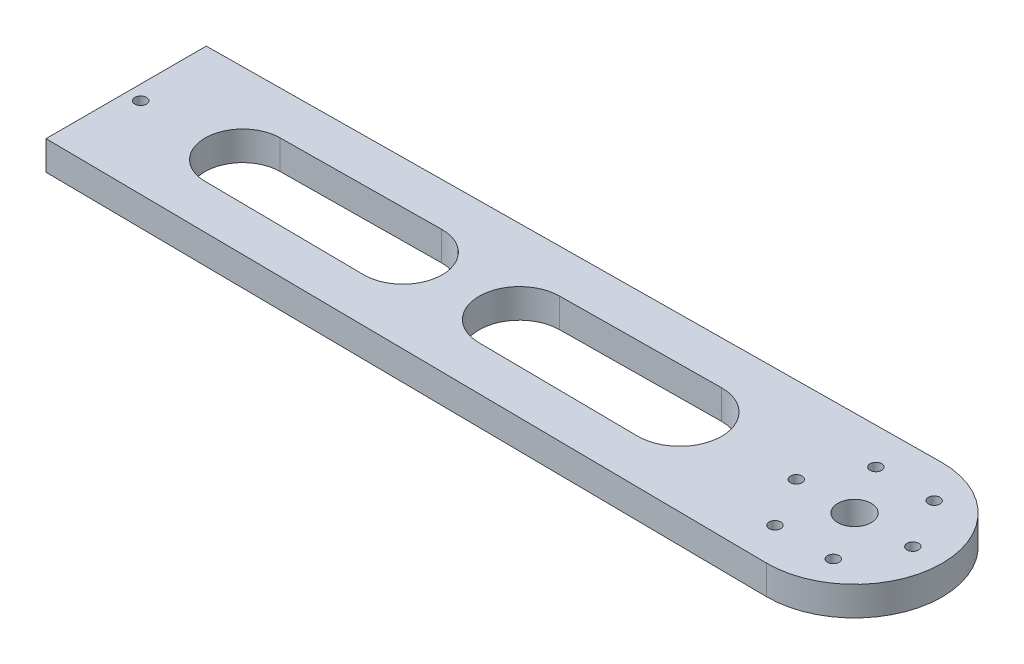
ISO-10303-21;
HEADER;
FILE_DESCRIPTION(('STEP AP214'),'2;1');
FILE_NAME('part.step','',(''),(''),'','','');
FILE_SCHEMA(('AUTOMOTIVE_DESIGN { 1 0 10303 214 1 1 1 1 }'));
ENDSEC;
DATA;
#1=APPLICATION_CONTEXT('core data for automotive mechanical design processes');
#2=APPLICATION_PROTOCOL_DEFINITION('international standard','automotive_design',2000,#1);
#3=PRODUCT_CONTEXT('',#1,'mechanical');
#4=PRODUCT('Part','Part','',(#3));
#5=PRODUCT_RELATED_PRODUCT_CATEGORY('part','',(#4));
#6=PRODUCT_DEFINITION_FORMATION('','',#4);
#7=PRODUCT_DEFINITION_CONTEXT('part definition',#1,'design');
#8=PRODUCT_DEFINITION('design','',#6,#7);
#9=PRODUCT_DEFINITION_SHAPE('','',#8);
#10=(LENGTH_UNIT() NAMED_UNIT(*) SI_UNIT(.MILLI.,.METRE.));
#11=(NAMED_UNIT(*) PLANE_ANGLE_UNIT() SI_UNIT($,.RADIAN.));
#12=(NAMED_UNIT(*) SI_UNIT($,.STERADIAN.) SOLID_ANGLE_UNIT());
#13=UNCERTAINTY_MEASURE_WITH_UNIT(LENGTH_MEASURE(1.E-05),#10,'distance_accuracy_value','');
#14=(GEOMETRIC_REPRESENTATION_CONTEXT(3) GLOBAL_UNCERTAINTY_ASSIGNED_CONTEXT((#13)) GLOBAL_UNIT_ASSIGNED_CONTEXT((#10,
#11,#12)) REPRESENTATION_CONTEXT('',''));
#15=CARTESIAN_POINT('',(0.,0.,0.));
#16=DIRECTION('',(0.,0.,1.));
#17=DIRECTION('',(1.,0.,0.));
#18=AXIS2_PLACEMENT_3D('',#15,#16,#17);
#19=CARTESIAN_POINT('',(33.6152394142152,10.,-9.95522460733301));
#20=DIRECTION('',(0.,1.,0.));
#21=DIRECTION('',(0.,0.,1.));
#22=AXIS2_PLACEMENT_3D('',#19,#20,#21);
#23=PLANE('',#22);
#24=DIRECTION('',(0.999948973181895,0.,0.0101020311063743));
#25=VECTOR('',#24,1.);
#26=CARTESIAN_POINT('',(-81.52466678409,10.,3.88233456528161));
#27=LINE('',#26,#25);
#28=CARTESIAN_POINT('',(-81.52466678409,10.,3.88233456528161));
#29=VERTEX_POINT('',#28);
#30=CARTESIAN_POINT('',(-26.5302262167507,10.,4.43791846424908));
#31=VERTEX_POINT('',#30);
#32=EDGE_CURVE('E130',#29,#31,#27,.T.);
#33=ORIENTED_EDGE('',*,*,#32,.F.);
#34=CARTESIAN_POINT('',(-81.3847600499998,10.,-9.96632553302472));
#35=DIRECTION('',(0.,1.,0.));
#36=DIRECTION('',(0.,0.,1.));
#37=AXIS2_PLACEMENT_3D('',#34,#35,#36);
#38=CIRCLE('',#37,13.8493667874263);
#39=CARTESIAN_POINT('',(-81.5219931650311,10.,-23.8150123835822));
#40=VERTEX_POINT('',#39);
#41=EDGE_CURVE('E122',#40,#29,#38,.T.);
#42=ORIENTED_EDGE('',*,*,#41,.F.);
#43=DIRECTION('',(-0.999950904840691,0.,0.00990898119298126));
#44=VECTOR('',#43,1.);
#45=CARTESIAN_POINT('',(-81.5219931650311,10.,-23.8150123835822));
#46=LINE('',#45,#44);
#47=CARTESIAN_POINT('',(-26.5274463617761,10.,-24.3599790687984));
#48=VERTEX_POINT('',#47);
#49=EDGE_CURVE('E145',#48,#40,#46,.T.);
#50=ORIENTED_EDGE('',*,*,#49,.F.);
#51=CARTESIAN_POINT('',(-26.3847603062448,10.,-9.96101639465042));
#52=DIRECTION('',(0.,1.,0.));
#53=DIRECTION('',(0.,0.,1.));
#54=AXIS2_PLACEMENT_3D('',#51,#52,#53);
#55=CIRCLE('',#54,14.3996696282224);
#56=EDGE_CURVE('E143',#31,#48,#55,.T.);
#57=ORIENTED_EDGE('',*,*,#56,.F.);
#58=EDGE_LOOP('',(#33,#42,#50,#57));
#59=FACE_BOUND('',#58,.T.);
#60=CARTESIAN_POINT('',(23.6152394142153,10.,-27.2757326830219));
#61=DIRECTION('',(0.,1.,0.));
#62=DIRECTION('',(0.,0.,1.));
#63=AXIS2_PLACEMENT_3D('',#60,#61,#62);
#64=CIRCLE('',#63,2.);
#65=CARTESIAN_POINT('',(23.6152394142153,10.,-25.2757326830219));
#66=VERTEX_POINT('',#65);
#67=EDGE_CURVE('E161',#66,#66,#64,.T.);
#68=ORIENTED_EDGE('',*,*,#67,.F.);
#69=EDGE_LOOP('',(#68));
#70=FACE_BOUND('',#69,.T.);
#71=CARTESIAN_POINT('',(23.6152394142151,10.,7.36528346835572));
#72=DIRECTION('',(0.,1.,0.));
#73=DIRECTION('',(0.,0.,1.));
#74=AXIS2_PLACEMENT_3D('',#71,#72,#73);
#75=CIRCLE('',#74,2.);
#76=CARTESIAN_POINT('',(23.6152394142151,10.,9.36528346835572));
#77=VERTEX_POINT('',#76);
#78=EDGE_CURVE('E173',#77,#77,#75,.T.);
#79=ORIENTED_EDGE('',*,*,#78,.F.);
#80=EDGE_LOOP('',(#79));
#81=FACE_BOUND('',#80,.T.);
#82=CARTESIAN_POINT('',(-211.384759397752,10.,-9.97935692636639));
#83=DIRECTION('',(0.,1.,0.));
#84=DIRECTION('',(0.,0.,1.));
#85=AXIS2_PLACEMENT_3D('',#82,#83,#84);
#86=CIRCLE('',#85,2.);
#87=CARTESIAN_POINT('',(-211.384759397752,10.,-7.9793569263664));
#88=VERTEX_POINT('',#87);
#89=EDGE_CURVE('E185',#88,#88,#86,.T.);
#90=ORIENTED_EDGE('',*,*,#89,.F.);
#91=EDGE_LOOP('',(#90));
#92=FACE_BOUND('',#91,.T.);
#93=CARTESIAN_POINT('',(33.6152394142152,10.,-9.95522460733301));
#94=DIRECTION('',(0.,1.,0.));
#95=DIRECTION('',(0.,0.,1.));
#96=AXIS2_PLACEMENT_3D('',#93,#94,#95);
#97=CIRCLE('',#96,5.75);
#98=CARTESIAN_POINT('',(33.6152394142152,10.,-4.20522460733302));
#99=VERTEX_POINT('',#98);
#100=EDGE_CURVE('E228',#99,#99,#97,.T.);
#101=ORIENTED_EDGE('',*,*,#100,.F.);
#102=EDGE_LOOP('',(#101));
#103=FACE_BOUND('',#102,.T.);
#104=DIRECTION('',(-9.65297886194745E-05,0.,0.999999995341));
#105=VECTOR('',#104,1.);
#106=CARTESIAN_POINT('',(-216.382104851848,10.,-37.4793569263664));
#107=LINE('',#106,#105);
#108=CARTESIAN_POINT('',(-216.382104851848,10.,-37.4793569263664));
#109=VERTEX_POINT('',#108);
#110=CARTESIAN_POINT('',(-216.387413990222,10.,17.5206428173886));
#111=VERTEX_POINT('',#110);
#112=EDGE_CURVE('E234',#109,#111,#107,.T.);
#113=ORIENTED_EDGE('',*,*,#112,.T.);
#114=DIRECTION('',(0.999948973181895,0.,0.0101020311063743));
#115=VECTOR('',#114,1.);
#116=CARTESIAN_POINT('',(-216.387413990222,10.,17.5206428173886));
#117=LINE('',#116,#115);
#118=CARTESIAN_POINT('',(33.3121784810239,10.,20.0432445881238));
#119=VERTEX_POINT('',#118);
#120=EDGE_CURVE('E237',#111,#119,#117,.T.);
#121=ORIENTED_EDGE('',*,*,#120,.T.);
#122=CARTESIAN_POINT('',(33.6152394142152,10.,-9.95522460733301));
#123=DIRECTION('',(0.,1.,0.));
#124=DIRECTION('',(0.,0.,1.));
#125=AXIS2_PLACEMENT_3D('',#122,#123,#124);
#126=CIRCLE('',#125,30.);
#127=CARTESIAN_POINT('',(33.3179699784257,10.,-39.9537517525538));
#128=VERTEX_POINT('',#127);
#129=EDGE_CURVE('E240',#119,#128,#126,.T.);
#130=ORIENTED_EDGE('',*,*,#129,.T.);
#131=DIRECTION('',(-0.999950904840691,0.,0.00990898119298121));
#132=VECTOR('',#131,1.);
#133=CARTESIAN_POINT('',(-216.382104851848,10.,-37.4793569263664));
#134=LINE('',#133,#132);
#135=EDGE_CURVE('E242',#128,#109,#134,.T.);
#136=ORIENTED_EDGE('',*,*,#135,.T.);
#137=EDGE_LOOP('',(#113,#121,#130,#136));
#138=FACE_BOUND('',#137,.T.);
#139=CARTESIAN_POINT('',(53.6152394142152,10.,-9.95522460733301));
#140=DIRECTION('',(0.,1.,0.));
#141=DIRECTION('',(0.,0.,1.));
#142=AXIS2_PLACEMENT_3D('',#139,#140,#141);
#143=CIRCLE('',#142,2.);
#144=CARTESIAN_POINT('',(53.6152394142152,10.,-7.95522460733301));
#145=VERTEX_POINT('',#144);
#146=EDGE_CURVE('E222',#145,#145,#143,.T.);
#147=ORIENTED_EDGE('',*,*,#146,.F.);
#148=EDGE_LOOP('',(#147));
#149=FACE_BOUND('',#148,.T.);
#150=DIRECTION('',(-0.999950904840691,0.,0.00990898119298113));
#151=VECTOR('',#150,1.);
#152=CARTESIAN_POINT('',(-176.512574007017,10.,-22.873706290936));
#153=LINE('',#152,#151);
#154=CARTESIAN_POINT('',(-121.518027203762,10.,-23.4186729761523));
#155=VERTEX_POINT('',#154);
#156=CARTESIAN_POINT('',(-176.512574007017,10.,-22.873706290936));
#157=VERTEX_POINT('',#156);
#158=EDGE_CURVE('E193',#155,#157,#153,.T.);
#159=ORIENTED_EDGE('',*,*,#158,.F.);
#160=CARTESIAN_POINT('',(-121.38475986364,10.,-9.97018672456965));
#161=DIRECTION('',(0.,1.,0.));
#162=DIRECTION('',(0.,0.,1.));
#163=AXIS2_PLACEMENT_3D('',#160,#161,#162);
#164=CIRCLE('',#163,13.4491465395745);
#165=CARTESIAN_POINT('',(-121.520623560337,10.,3.47827354785072));
#166=VERTEX_POINT('',#165);
#167=EDGE_CURVE('E191',#166,#155,#164,.T.);
#168=ORIENTED_EDGE('',*,*,#167,.F.);
#169=DIRECTION('',(0.999948973181895,0.,0.0101020311063743));
#170=VECTOR('',#169,1.);
#171=CARTESIAN_POINT('',(-176.515064127676,10.,2.92268964888325));
#172=LINE('',#171,#170);
#173=CARTESIAN_POINT('',(-176.515064127676,10.,2.92268964888325));
#174=VERTEX_POINT('',#173);
#175=EDGE_CURVE('E199',#174,#166,#172,.T.);
#176=ORIENTED_EDGE('',*,*,#175,.F.);
#177=CARTESIAN_POINT('',(-176.384759607395,10.,-9.97549586294395));
#178=DIRECTION('',(0.,1.,0.));
#179=DIRECTION('',(0.,0.,1.));
#180=AXIS2_PLACEMENT_3D('',#177,#178,#179);
#181=CIRCLE('',#180,12.8988436987784);
#182=EDGE_CURVE('E196',#157,#174,#181,.T.);
#183=ORIENTED_EDGE('',*,*,#182,.F.);
#184=EDGE_LOOP('',(#159,#168,#176,#183));
#185=FACE_BOUND('',#184,.T.);
#186=CARTESIAN_POINT('',(43.6152394142151,10.,7.36528346835578));
#187=DIRECTION('',(0.,1.,0.));
#188=DIRECTION('',(0.,0.,1.));
#189=AXIS2_PLACEMENT_3D('',#186,#187,#188);
#190=CIRCLE('',#189,2.);
#191=CARTESIAN_POINT('',(43.6152394142151,10.,9.36528346835578));
#192=VERTEX_POINT('',#191);
#193=EDGE_CURVE('E179',#192,#192,#190,.T.);
#194=ORIENTED_EDGE('',*,*,#193,.F.);
#195=EDGE_LOOP('',(#194));
#196=FACE_BOUND('',#195,.T.);
#197=CARTESIAN_POINT('',(13.6152394142152,10.,-9.95522460733315));
#198=DIRECTION('',(0.,1.,0.));
#199=DIRECTION('',(0.,0.,1.));
#200=AXIS2_PLACEMENT_3D('',#197,#198,#199);
#201=CIRCLE('',#200,2.);
#202=CARTESIAN_POINT('',(13.6152394142152,10.,-7.95522460733315));
#203=VERTEX_POINT('',#202);
#204=EDGE_CURVE('E167',#203,#203,#201,.T.);
#205=ORIENTED_EDGE('',*,*,#204,.F.);
#206=EDGE_LOOP('',(#205));
#207=FACE_BOUND('',#206,.T.);
#208=CARTESIAN_POINT('',(43.6152394142154,10.,-27.2757326830217));
#209=DIRECTION('',(0.,1.,0.));
#210=DIRECTION('',(0.,0.,1.));
#211=AXIS2_PLACEMENT_3D('',#208,#209,#210);
#212=CIRCLE('',#211,2.);
#213=CARTESIAN_POINT('',(43.6152394142154,10.,-25.2757326830217));
#214=VERTEX_POINT('',#213);
#215=EDGE_CURVE('E151',#214,#214,#212,.T.);
#216=ORIENTED_EDGE('',*,*,#215,.F.);
#217=EDGE_LOOP('',(#216));
#218=FACE_BOUND('',#217,.T.);
#219=ADVANCED_FACE('F33',(#59,#70,#81,#92,#103,#138,#149,#185,#196,#207,#218),#23,.T.);
#220=CARTESIAN_POINT('',(33.6152394142152,0.,-9.95522460733301));
#221=DIRECTION('',(0.,1.,0.));
#222=DIRECTION('',(0.,0.,1.));
#223=AXIS2_PLACEMENT_3D('',#220,#221,#222);
#224=PLANE('',#223);
#225=CARTESIAN_POINT('',(23.6152394142153,0.,-27.2757326830219));
#226=DIRECTION('',(0.,1.,0.));
#227=DIRECTION('',(0.,0.,1.));
#228=AXIS2_PLACEMENT_3D('',#225,#226,#227);
#229=CIRCLE('',#228,2.);
#230=CARTESIAN_POINT('',(23.6152394142153,0.,-25.2757326830219));
#231=VERTEX_POINT('',#230);
#232=EDGE_CURVE('E138',#231,#231,#229,.T.);
#233=ORIENTED_EDGE('',*,*,#232,.T.);
#234=EDGE_LOOP('',(#233));
#235=FACE_BOUND('',#234,.T.);
#236=CARTESIAN_POINT('',(13.6152394142152,0.,-9.95522460733315));
#237=DIRECTION('',(0.,1.,0.));
#238=DIRECTION('',(0.,0.,1.));
#239=AXIS2_PLACEMENT_3D('',#236,#237,#238);
#240=CIRCLE('',#239,2.);
#241=CARTESIAN_POINT('',(13.6152394142152,0.,-7.95522460733315));
#242=VERTEX_POINT('',#241);
#243=EDGE_CURVE('E164',#242,#242,#240,.T.);
#244=ORIENTED_EDGE('',*,*,#243,.T.);
#245=EDGE_LOOP('',(#244));
#246=FACE_BOUND('',#245,.T.);
#247=CARTESIAN_POINT('',(23.6152394142151,0.,7.36528346835572));
#248=DIRECTION('',(0.,1.,0.));
#249=DIRECTION('',(0.,0.,1.));
#250=AXIS2_PLACEMENT_3D('',#247,#248,#249);
#251=CIRCLE('',#250,2.);
#252=CARTESIAN_POINT('',(23.6152394142151,0.,9.36528346835572));
#253=VERTEX_POINT('',#252);
#254=EDGE_CURVE('E170',#253,#253,#251,.T.);
#255=ORIENTED_EDGE('',*,*,#254,.T.);
#256=EDGE_LOOP('',(#255));
#257=FACE_BOUND('',#256,.T.);
#258=CARTESIAN_POINT('',(43.6152394142151,0.,7.36528346835578));
#259=DIRECTION('',(0.,1.,0.));
#260=DIRECTION('',(0.,0.,1.));
#261=AXIS2_PLACEMENT_3D('',#258,#259,#260);
#262=CIRCLE('',#261,2.);
#263=CARTESIAN_POINT('',(43.6152394142151,0.,9.36528346835578));
#264=VERTEX_POINT('',#263);
#265=EDGE_CURVE('E176',#264,#264,#262,.T.);
#266=ORIENTED_EDGE('',*,*,#265,.T.);
#267=EDGE_LOOP('',(#266));
#268=FACE_BOUND('',#267,.T.);
#269=CARTESIAN_POINT('',(-211.384759397752,0.,-9.97935692636639));
#270=DIRECTION('',(0.,1.,0.));
#271=DIRECTION('',(0.,0.,1.));
#272=AXIS2_PLACEMENT_3D('',#269,#270,#271);
#273=CIRCLE('',#272,2.);
#274=CARTESIAN_POINT('',(-211.384759397752,0.,-7.9793569263664));
#275=VERTEX_POINT('',#274);
#276=EDGE_CURVE('E182',#275,#275,#273,.T.);
#277=ORIENTED_EDGE('',*,*,#276,.T.);
#278=EDGE_LOOP('',(#277));
#279=FACE_BOUND('',#278,.T.);
#280=CARTESIAN_POINT('',(-121.38475986364,0.,-9.97018672456965));
#281=DIRECTION('',(0.,1.,0.));
#282=DIRECTION('',(0.,0.,1.));
#283=AXIS2_PLACEMENT_3D('',#280,#281,#282);
#284=CIRCLE('',#283,13.4491465395745);
#285=CARTESIAN_POINT('',(-121.520623560337,0.,3.47827354785072));
#286=VERTEX_POINT('',#285);
#287=CARTESIAN_POINT('',(-121.518027203762,0.,-23.4186729761523));
#288=VERTEX_POINT('',#287);
#289=EDGE_CURVE('E188',#286,#288,#284,.T.);
#290=ORIENTED_EDGE('',*,*,#289,.T.);
#291=DIRECTION('',(-0.999950904840691,0.,0.00990898119298113));
#292=VECTOR('',#291,1.);
#293=CARTESIAN_POINT('',(-176.512574007017,0.,-22.873706290936));
#294=LINE('',#293,#292);
#295=CARTESIAN_POINT('',(-176.512574007017,0.,-22.873706290936));
#296=VERTEX_POINT('',#295);
#297=EDGE_CURVE('E204',#288,#296,#294,.T.);
#298=ORIENTED_EDGE('',*,*,#297,.T.);
#299=CARTESIAN_POINT('',(-176.384759607395,0.,-9.97549586294395));
#300=DIRECTION('',(0.,1.,0.));
#301=DIRECTION('',(0.,0.,1.));
#302=AXIS2_PLACEMENT_3D('',#299,#300,#301);
#303=CIRCLE('',#302,12.8988436987784);
#304=CARTESIAN_POINT('',(-176.515064127676,0.,2.92268964888325));
#305=VERTEX_POINT('',#304);
#306=EDGE_CURVE('E207',#296,#305,#303,.T.);
#307=ORIENTED_EDGE('',*,*,#306,.T.);
#308=DIRECTION('',(0.999948973181895,0.,0.0101020311063743));
#309=VECTOR('',#308,1.);
#310=CARTESIAN_POINT('',(-176.515064127676,0.,2.92268964888325));
#311=LINE('',#310,#309);
#312=EDGE_CURVE('E194',#305,#286,#311,.T.);
#313=ORIENTED_EDGE('',*,*,#312,.T.);
#314=EDGE_LOOP('',(#290,#298,#307,#313));
#315=FACE_BOUND('',#314,.T.);
#316=DIRECTION('',(-9.65297886194745E-05,0.,0.999999995341));
#317=VECTOR('',#316,1.);
#318=CARTESIAN_POINT('',(-216.382104851848,0.,-37.4793569263664));
#319=LINE('',#318,#317);
#320=CARTESIAN_POINT('',(-216.382104851848,0.,-37.4793569263664));
#321=VERTEX_POINT('',#320);
#322=CARTESIAN_POINT('',(-216.387413990222,0.,17.5206428173886));
#323=VERTEX_POINT('',#322);
#324=EDGE_CURVE('E231',#321,#323,#319,.T.);
#325=ORIENTED_EDGE('',*,*,#324,.F.);
#326=DIRECTION('',(-0.999950904840691,0.,0.00990898119298121));
#327=VECTOR('',#326,1.);
#328=CARTESIAN_POINT('',(-216.382104851848,0.,-37.4793569263664));
#329=LINE('',#328,#327);
#330=CARTESIAN_POINT('',(33.3179699784257,0.,-39.9537517525538));
#331=VERTEX_POINT('',#330);
#332=EDGE_CURVE('E238',#331,#321,#329,.T.);
#333=ORIENTED_EDGE('',*,*,#332,.F.);
#334=CARTESIAN_POINT('',(33.6152394142152,0.,-9.95522460733301));
#335=DIRECTION('',(0.,1.,0.));
#336=DIRECTION('',(0.,0.,1.));
#337=AXIS2_PLACEMENT_3D('',#334,#335,#336);
#338=CIRCLE('',#337,30.);
#339=CARTESIAN_POINT('',(33.3121784810239,0.,20.0432445881238));
#340=VERTEX_POINT('',#339);
#341=EDGE_CURVE('E249',#340,#331,#338,.T.);
#342=ORIENTED_EDGE('',*,*,#341,.F.);
#343=DIRECTION('',(0.999948973181895,0.,0.0101020311063743));
#344=VECTOR('',#343,1.);
#345=CARTESIAN_POINT('',(-216.387413990222,0.,17.5206428173886));
#346=LINE('',#345,#344);
#347=EDGE_CURVE('E247',#323,#340,#346,.T.);
#348=ORIENTED_EDGE('',*,*,#347,.F.);
#349=EDGE_LOOP('',(#325,#333,#342,#348));
#350=FACE_BOUND('',#349,.T.);
#351=CARTESIAN_POINT('',(33.6152394142152,0.,-9.95522460733301));
#352=DIRECTION('',(0.,1.,0.));
#353=DIRECTION('',(0.,0.,1.));
#354=AXIS2_PLACEMENT_3D('',#351,#352,#353);
#355=CIRCLE('',#354,5.75);
#356=CARTESIAN_POINT('',(33.6152394142152,0.,-4.20522460733302));
#357=VERTEX_POINT('',#356);
#358=EDGE_CURVE('E225',#357,#357,#355,.T.);
#359=ORIENTED_EDGE('',*,*,#358,.T.);
#360=EDGE_LOOP('',(#359));
#361=FACE_BOUND('',#360,.T.);
#362=CARTESIAN_POINT('',(53.6152394142152,0.,-9.95522460733301));
#363=DIRECTION('',(0.,1.,0.));
#364=DIRECTION('',(0.,0.,1.));
#365=AXIS2_PLACEMENT_3D('',#362,#363,#364);
#366=CIRCLE('',#365,2.);
#367=CARTESIAN_POINT('',(53.6152394142152,0.,-7.95522460733301));
#368=VERTEX_POINT('',#367);
#369=EDGE_CURVE('E221',#368,#368,#366,.T.);
#370=ORIENTED_EDGE('',*,*,#369,.T.);
#371=EDGE_LOOP('',(#370));
#372=FACE_BOUND('',#371,.T.);
#373=CARTESIAN_POINT('',(-81.3847600499998,0.,-9.96632553302472));
#374=DIRECTION('',(0.,1.,0.));
#375=DIRECTION('',(0.,0.,1.));
#376=AXIS2_PLACEMENT_3D('',#373,#374,#375);
#377=CIRCLE('',#376,13.8493667874263);
#378=CARTESIAN_POINT('',(-81.5219931650311,0.,-23.8150123835822));
#379=VERTEX_POINT('',#378);
#380=CARTESIAN_POINT('',(-81.52466678409,0.,3.88233456528161));
#381=VERTEX_POINT('',#380);
#382=EDGE_CURVE('E56',#379,#381,#377,.T.);
#383=ORIENTED_EDGE('',*,*,#382,.T.);
#384=DIRECTION('',(0.999948973181895,0.,0.0101020311063743));
#385=VECTOR('',#384,1.);
#386=CARTESIAN_POINT('',(-81.52466678409,0.,3.88233456528161));
#387=LINE('',#386,#385);
#388=CARTESIAN_POINT('',(-26.5302262167507,0.,4.43791846424908));
#389=VERTEX_POINT('',#388);
#390=EDGE_CURVE('E137',#381,#389,#387,.T.);
#391=ORIENTED_EDGE('',*,*,#390,.T.);
#392=CARTESIAN_POINT('',(-26.3847603062448,0.,-9.96101639465042));
#393=DIRECTION('',(0.,1.,0.));
#394=DIRECTION('',(0.,0.,1.));
#395=AXIS2_PLACEMENT_3D('',#392,#393,#394);
#396=CIRCLE('',#395,14.3996696282224);
#397=CARTESIAN_POINT('',(-26.5274463617761,0.,-24.3599790687984));
#398=VERTEX_POINT('',#397);
#399=EDGE_CURVE('E153',#389,#398,#396,.T.);
#400=ORIENTED_EDGE('',*,*,#399,.T.);
#401=DIRECTION('',(-0.999950904840691,0.,0.00990898119298126));
#402=VECTOR('',#401,1.);
#403=CARTESIAN_POINT('',(-81.5219931650311,0.,-23.8150123835822));
#404=LINE('',#403,#402);
#405=EDGE_CURVE('E131',#398,#379,#404,.T.);
#406=ORIENTED_EDGE('',*,*,#405,.T.);
#407=EDGE_LOOP('',(#383,#391,#400,#406));
#408=FACE_BOUND('',#407,.T.);
#409=CARTESIAN_POINT('',(43.6152394142154,0.,-27.2757326830217));
#410=DIRECTION('',(0.,1.,0.));
#411=DIRECTION('',(0.,0.,1.));
#412=AXIS2_PLACEMENT_3D('',#409,#410,#411);
#413=CIRCLE('',#412,2.);
#414=CARTESIAN_POINT('',(43.6152394142154,0.,-25.2757326830217));
#415=VERTEX_POINT('',#414);
#416=EDGE_CURVE('E316',#415,#415,#413,.T.);
#417=ORIENTED_EDGE('',*,*,#416,.T.);
#418=EDGE_LOOP('',(#417));
#419=FACE_BOUND('',#418,.T.);
#420=ADVANCED_FACE('F267',(#235,#246,#257,#268,#279,#315,#350,#361,#372,#408,#419),#224,.F.);
#421=CARTESIAN_POINT('',(-216.382104851848,10.,-37.4793569263664));
#422=DIRECTION('',(0.999999995341,0.,9.65297886194745E-05));
#423=DIRECTION('',(9.65297886194745E-05,0.,-0.999999995341));
#424=AXIS2_PLACEMENT_3D('',#421,#422,#423);
#425=PLANE('',#424);
#426=ORIENTED_EDGE('',*,*,#324,.T.);
#427=DIRECTION('',(0.,-1.,0.));
#428=VECTOR('',#427,1.);
#429=CARTESIAN_POINT('',(-216.387413990222,10.,17.5206428173886));
#430=LINE('',#429,#428);
#431=EDGE_CURVE('E11',#111,#323,#430,.T.);
#432=ORIENTED_EDGE('',*,*,#431,.F.);
#433=ORIENTED_EDGE('',*,*,#112,.F.);
#434=DIRECTION('',(0.,-1.,0.));
#435=VECTOR('',#434,1.);
#436=CARTESIAN_POINT('',(-216.382104851848,10.,-37.4793569263664));
#437=LINE('',#436,#435);
#438=EDGE_CURVE('E244',#109,#321,#437,.T.);
#439=ORIENTED_EDGE('',*,*,#438,.T.);
#440=EDGE_LOOP('',(#426,#432,#433,#439));
#441=FACE_BOUND('',#440,.T.);
#442=ADVANCED_FACE('F35',(#441),#425,.F.);
#443=CARTESIAN_POINT('',(-216.387413990222,10.,17.5206428173886));
#444=DIRECTION('',(0.0101020311063743,0.,-0.999948973181895));
#445=DIRECTION('',(-0.999948973181895,0.,-0.0101020311063743));
#446=AXIS2_PLACEMENT_3D('',#443,#444,#445);
#447=PLANE('',#446);
#448=ORIENTED_EDGE('',*,*,#347,.T.);
#449=DIRECTION('',(0.,-1.,0.));
#450=VECTOR('',#449,1.);
#451=CARTESIAN_POINT('',(33.3121784810239,10.,20.0432445881238));
#452=LINE('',#451,#450);
#453=EDGE_CURVE('E41',#119,#340,#452,.T.);
#454=ORIENTED_EDGE('',*,*,#453,.F.);
#455=ORIENTED_EDGE('',*,*,#120,.F.);
#456=ORIENTED_EDGE('',*,*,#431,.T.);
#457=EDGE_LOOP('',(#448,#454,#455,#456));
#458=FACE_BOUND('',#457,.T.);
#459=ADVANCED_FACE('F278',(#458),#447,.F.);
#460=CARTESIAN_POINT('',(33.6152394142152,10.,-9.95522460733301));
#461=DIRECTION('',(0.,-1.,0.));
#462=DIRECTION('',(0.,0.,-1.));
#463=AXIS2_PLACEMENT_3D('',#460,#461,#462);
#464=CYLINDRICAL_SURFACE('',#463,30.);
#465=ORIENTED_EDGE('',*,*,#341,.T.);
#466=DIRECTION('',(0.,-1.,0.));
#467=VECTOR('',#466,1.);
#468=CARTESIAN_POINT('',(33.3179699784257,10.,-39.9537517525538));
#469=LINE('',#468,#467);
#470=EDGE_CURVE('E254',#128,#331,#469,.T.);
#471=ORIENTED_EDGE('',*,*,#470,.F.);
#472=ORIENTED_EDGE('',*,*,#129,.F.);
#473=ORIENTED_EDGE('',*,*,#453,.T.);
#474=EDGE_LOOP('',(#465,#471,#472,#473));
#475=FACE_BOUND('',#474,.T.);
#476=ADVANCED_FACE('F261',(#475),#464,.T.);
#477=CARTESIAN_POINT('',(-216.382104851848,10.,-37.4793569263664));
#478=DIRECTION('',(0.00990898119298121,0.,0.999950904840691));
#479=DIRECTION('',(0.999950904840691,0.,-0.00990898119298121));
#480=AXIS2_PLACEMENT_3D('',#477,#478,#479);
#481=PLANE('',#480);
#482=ORIENTED_EDGE('',*,*,#332,.T.);
#483=ORIENTED_EDGE('',*,*,#438,.F.);
#484=ORIENTED_EDGE('',*,*,#135,.F.);
#485=ORIENTED_EDGE('',*,*,#470,.T.);
#486=EDGE_LOOP('',(#482,#483,#484,#485));
#487=FACE_BOUND('',#486,.T.);
#488=ADVANCED_FACE('F271',(#487),#481,.F.);
#489=CARTESIAN_POINT('',(33.6152394142152,10.,-9.95522460733301));
#490=DIRECTION('',(0.,-1.,0.));
#491=DIRECTION('',(0.,0.,-1.));
#492=AXIS2_PLACEMENT_3D('',#489,#490,#491);
#493=CYLINDRICAL_SURFACE('',#492,5.75);
#494=ORIENTED_EDGE('',*,*,#100,.T.);
#495=EDGE_LOOP('',(#494));
#496=FACE_BOUND('',#495,.T.);
#497=ORIENTED_EDGE('',*,*,#358,.F.);
#498=EDGE_LOOP('',(#497));
#499=FACE_BOUND('',#498,.T.);
#500=ADVANCED_FACE('F293',(#496,#499),#493,.F.);
#501=CARTESIAN_POINT('',(53.6152394142152,10.,-9.95522460733301));
#502=DIRECTION('',(0.,-1.,0.));
#503=DIRECTION('',(0.,0.,-1.));
#504=AXIS2_PLACEMENT_3D('',#501,#502,#503);
#505=CYLINDRICAL_SURFACE('',#504,2.);
#506=ORIENTED_EDGE('',*,*,#146,.T.);
#507=EDGE_LOOP('',(#506));
#508=FACE_BOUND('',#507,.T.);
#509=ORIENTED_EDGE('',*,*,#369,.F.);
#510=EDGE_LOOP('',(#509));
#511=FACE_BOUND('',#510,.T.);
#512=ADVANCED_FACE('F300',(#508,#511),#505,.F.);
#513=CARTESIAN_POINT('',(-121.38475986364,10.,-9.97018672456965));
#514=DIRECTION('',(0.,-1.,0.));
#515=DIRECTION('',(0.,0.,-1.));
#516=AXIS2_PLACEMENT_3D('',#513,#514,#515);
#517=CYLINDRICAL_SURFACE('',#516,13.4491465395745);
#518=ORIENTED_EDGE('',*,*,#289,.F.);
#519=DIRECTION('',(0.,-1.,0.));
#520=VECTOR('',#519,1.);
#521=CARTESIAN_POINT('',(-121.520623560337,10.,3.47827354785072));
#522=LINE('',#521,#520);
#523=EDGE_CURVE('E201',#166,#286,#522,.T.);
#524=ORIENTED_EDGE('',*,*,#523,.F.);
#525=ORIENTED_EDGE('',*,*,#167,.T.);
#526=DIRECTION('',(0.,-1.,0.));
#527=VECTOR('',#526,1.);
#528=CARTESIAN_POINT('',(-121.518027203762,10.,-23.4186729761523));
#529=LINE('',#528,#527);
#530=EDGE_CURVE('E218',#155,#288,#529,.T.);
#531=ORIENTED_EDGE('',*,*,#530,.T.);
#532=EDGE_LOOP('',(#518,#524,#525,#531));
#533=FACE_BOUND('',#532,.T.);
#534=ADVANCED_FACE('F305',(#533),#517,.F.);
#535=CARTESIAN_POINT('',(-176.512574007017,10.,-22.873706290936));
#536=DIRECTION('',(0.00990898119298113,0.,0.999950904840691));
#537=DIRECTION('',(0.999950904840691,0.,-0.00990898119298113));
#538=AXIS2_PLACEMENT_3D('',#535,#536,#537);
#539=PLANE('',#538);
#540=ORIENTED_EDGE('',*,*,#297,.F.);
#541=ORIENTED_EDGE('',*,*,#530,.F.);
#542=ORIENTED_EDGE('',*,*,#158,.T.);
#543=DIRECTION('',(0.,-1.,0.));
#544=VECTOR('',#543,1.);
#545=CARTESIAN_POINT('',(-176.512574007017,10.,-22.873706290936));
#546=LINE('',#545,#544);
#547=EDGE_CURVE('E216',#157,#296,#546,.T.);
#548=ORIENTED_EDGE('',*,*,#547,.T.);
#549=EDGE_LOOP('',(#540,#541,#542,#548));
#550=FACE_BOUND('',#549,.T.);
#551=ADVANCED_FACE('F367',(#550),#539,.T.);
#552=CARTESIAN_POINT('',(-176.384759607395,10.,-9.97549586294395));
#553=DIRECTION('',(0.,-1.,0.));
#554=DIRECTION('',(0.,0.,-1.));
#555=AXIS2_PLACEMENT_3D('',#552,#553,#554);
#556=CYLINDRICAL_SURFACE('',#555,12.8988436987784);
#557=ORIENTED_EDGE('',*,*,#306,.F.);
#558=ORIENTED_EDGE('',*,*,#547,.F.);
#559=ORIENTED_EDGE('',*,*,#182,.T.);
#560=DIRECTION('',(0.,-1.,0.));
#561=VECTOR('',#560,1.);
#562=CARTESIAN_POINT('',(-176.515064127676,10.,2.92268964888325));
#563=LINE('',#562,#561);
#564=EDGE_CURVE('E214',#174,#305,#563,.T.);
#565=ORIENTED_EDGE('',*,*,#564,.T.);
#566=EDGE_LOOP('',(#557,#558,#559,#565));
#567=FACE_BOUND('',#566,.T.);
#568=ADVANCED_FACE('F363',(#567),#556,.F.);
#569=CARTESIAN_POINT('',(-176.515064127676,10.,2.92268964888325));
#570=DIRECTION('',(0.0101020311063743,0.,-0.999948973181895));
#571=DIRECTION('',(-0.999948973181895,0.,-0.0101020311063743));
#572=AXIS2_PLACEMENT_3D('',#569,#570,#571);
#573=PLANE('',#572);
#574=ORIENTED_EDGE('',*,*,#312,.F.);
#575=ORIENTED_EDGE('',*,*,#564,.F.);
#576=ORIENTED_EDGE('',*,*,#175,.T.);
#577=ORIENTED_EDGE('',*,*,#523,.T.);
#578=EDGE_LOOP('',(#574,#575,#576,#577));
#579=FACE_BOUND('',#578,.T.);
#580=ADVANCED_FACE('F359',(#579),#573,.T.);
#581=CARTESIAN_POINT('',(-211.384759397752,10.,-9.97935692636639));
#582=DIRECTION('',(0.,-1.,0.));
#583=DIRECTION('',(0.,0.,-1.));
#584=AXIS2_PLACEMENT_3D('',#581,#582,#583);
#585=CYLINDRICAL_SURFACE('',#584,2.);
#586=ORIENTED_EDGE('',*,*,#89,.T.);
#587=EDGE_LOOP('',(#586));
#588=FACE_BOUND('',#587,.T.);
#589=ORIENTED_EDGE('',*,*,#276,.F.);
#590=EDGE_LOOP('',(#589));
#591=FACE_BOUND('',#590,.T.);
#592=ADVANCED_FACE('F355',(#588,#591),#585,.F.);
#593=CARTESIAN_POINT('',(43.6152394142151,10.,7.36528346835578));
#594=DIRECTION('',(0.,-1.,0.));
#595=DIRECTION('',(0.,0.,-1.));
#596=AXIS2_PLACEMENT_3D('',#593,#594,#595);
#597=CYLINDRICAL_SURFACE('',#596,2.);
#598=ORIENTED_EDGE('',*,*,#193,.T.);
#599=EDGE_LOOP('',(#598));
#600=FACE_BOUND('',#599,.T.);
#601=ORIENTED_EDGE('',*,*,#265,.F.);
#602=EDGE_LOOP('',(#601));
#603=FACE_BOUND('',#602,.T.);
#604=ADVANCED_FACE('F351',(#600,#603),#597,.F.);
#605=CARTESIAN_POINT('',(23.6152394142151,10.,7.36528346835572));
#606=DIRECTION('',(0.,-1.,0.));
#607=DIRECTION('',(0.,0.,-1.));
#608=AXIS2_PLACEMENT_3D('',#605,#606,#607);
#609=CYLINDRICAL_SURFACE('',#608,2.);
#610=ORIENTED_EDGE('',*,*,#78,.T.);
#611=EDGE_LOOP('',(#610));
#612=FACE_BOUND('',#611,.T.);
#613=ORIENTED_EDGE('',*,*,#254,.F.);
#614=EDGE_LOOP('',(#613));
#615=FACE_BOUND('',#614,.T.);
#616=ADVANCED_FACE('F347',(#612,#615),#609,.F.);
#617=CARTESIAN_POINT('',(13.6152394142152,10.,-9.95522460733315));
#618=DIRECTION('',(0.,-1.,0.));
#619=DIRECTION('',(0.,0.,-1.));
#620=AXIS2_PLACEMENT_3D('',#617,#618,#619);
#621=CYLINDRICAL_SURFACE('',#620,2.);
#622=ORIENTED_EDGE('',*,*,#204,.T.);
#623=EDGE_LOOP('',(#622));
#624=FACE_BOUND('',#623,.T.);
#625=ORIENTED_EDGE('',*,*,#243,.F.);
#626=EDGE_LOOP('',(#625));
#627=FACE_BOUND('',#626,.T.);
#628=ADVANCED_FACE('F343',(#624,#627),#621,.F.);
#629=CARTESIAN_POINT('',(23.6152394142153,10.,-27.2757326830219));
#630=DIRECTION('',(0.,-1.,0.));
#631=DIRECTION('',(0.,0.,-1.));
#632=AXIS2_PLACEMENT_3D('',#629,#630,#631);
#633=CYLINDRICAL_SURFACE('',#632,2.);
#634=ORIENTED_EDGE('',*,*,#67,.T.);
#635=EDGE_LOOP('',(#634));
#636=FACE_BOUND('',#635,.T.);
#637=ORIENTED_EDGE('',*,*,#232,.F.);
#638=EDGE_LOOP('',(#637));
#639=FACE_BOUND('',#638,.T.);
#640=ADVANCED_FACE('F340',(#636,#639),#633,.F.);
#641=CARTESIAN_POINT('',(-81.3847600499998,10.,-9.96632553302472));
#642=DIRECTION('',(0.,-1.,0.));
#643=DIRECTION('',(0.,0.,-1.));
#644=AXIS2_PLACEMENT_3D('',#641,#642,#643);
#645=CYLINDRICAL_SURFACE('',#644,13.8493667874263);
#646=ORIENTED_EDGE('',*,*,#382,.F.);
#647=DIRECTION('',(0.,-1.,0.));
#648=VECTOR('',#647,1.);
#649=CARTESIAN_POINT('',(-81.5219931650311,10.,-23.8150123835822));
#650=LINE('',#649,#648);
#651=EDGE_CURVE('E126',#40,#379,#650,.T.);
#652=ORIENTED_EDGE('',*,*,#651,.F.);
#653=ORIENTED_EDGE('',*,*,#41,.T.);
#654=DIRECTION('',(0.,-1.,0.));
#655=VECTOR('',#654,1.);
#656=CARTESIAN_POINT('',(-81.52466678409,10.,3.88233456528161));
#657=LINE('',#656,#655);
#658=EDGE_CURVE('E125',#29,#381,#657,.T.);
#659=ORIENTED_EDGE('',*,*,#658,.T.);
#660=EDGE_LOOP('',(#646,#652,#653,#659));
#661=FACE_BOUND('',#660,.T.);
#662=ADVANCED_FACE('F124',(#661),#645,.F.);
#663=CARTESIAN_POINT('',(-81.52466678409,10.,3.88233456528161));
#664=DIRECTION('',(0.0101020311063743,0.,-0.999948973181895));
#665=DIRECTION('',(-0.999948973181895,0.,-0.0101020311063743));
#666=AXIS2_PLACEMENT_3D('',#663,#664,#665);
#667=PLANE('',#666);
#668=ORIENTED_EDGE('',*,*,#390,.F.);
#669=ORIENTED_EDGE('',*,*,#658,.F.);
#670=ORIENTED_EDGE('',*,*,#32,.T.);
#671=DIRECTION('',(0.,-1.,0.));
#672=VECTOR('',#671,1.);
#673=CARTESIAN_POINT('',(-26.5302262167507,10.,4.43791846424908));
#674=LINE('',#673,#672);
#675=EDGE_CURVE('E139',#31,#389,#674,.T.);
#676=ORIENTED_EDGE('',*,*,#675,.T.);
#677=EDGE_LOOP('',(#668,#669,#670,#676));
#678=FACE_BOUND('',#677,.T.);
#679=ADVANCED_FACE('F134',(#678),#667,.T.);
#680=CARTESIAN_POINT('',(-26.3847603062448,10.,-9.96101639465042));
#681=DIRECTION('',(0.,-1.,0.));
#682=DIRECTION('',(0.,0.,-1.));
#683=AXIS2_PLACEMENT_3D('',#680,#681,#682);
#684=CYLINDRICAL_SURFACE('',#683,14.3996696282224);
#685=ORIENTED_EDGE('',*,*,#399,.F.);
#686=ORIENTED_EDGE('',*,*,#675,.F.);
#687=ORIENTED_EDGE('',*,*,#56,.T.);
#688=DIRECTION('',(0.,-1.,0.));
#689=VECTOR('',#688,1.);
#690=CARTESIAN_POINT('',(-26.5274463617761,10.,-24.3599790687984));
#691=LINE('',#690,#689);
#692=EDGE_CURVE('E48',#48,#398,#691,.T.);
#693=ORIENTED_EDGE('',*,*,#692,.T.);
#694=EDGE_LOOP('',(#685,#686,#687,#693));
#695=FACE_BOUND('',#694,.T.);
#696=ADVANCED_FACE('F330',(#695),#684,.F.);
#697=CARTESIAN_POINT('',(-81.5219931650311,10.,-23.8150123835822));
#698=DIRECTION('',(0.00990898119298126,0.,0.999950904840691));
#699=DIRECTION('',(0.999950904840691,0.,-0.00990898119298126));
#700=AXIS2_PLACEMENT_3D('',#697,#698,#699);
#701=PLANE('',#700);
#702=ORIENTED_EDGE('',*,*,#405,.F.);
#703=ORIENTED_EDGE('',*,*,#692,.F.);
#704=ORIENTED_EDGE('',*,*,#49,.T.);
#705=ORIENTED_EDGE('',*,*,#651,.T.);
#706=EDGE_LOOP('',(#702,#703,#704,#705));
#707=FACE_BOUND('',#706,.T.);
#708=ADVANCED_FACE('F325',(#707),#701,.T.);
#709=CARTESIAN_POINT('',(43.6152394142154,10.,-27.2757326830217));
#710=DIRECTION('',(0.,-1.,0.));
#711=DIRECTION('',(0.,0.,-1.));
#712=AXIS2_PLACEMENT_3D('',#709,#710,#711);
#713=CYLINDRICAL_SURFACE('',#712,2.);
#714=ORIENTED_EDGE('',*,*,#215,.T.);
#715=EDGE_LOOP('',(#714));
#716=FACE_BOUND('',#715,.T.);
#717=ORIENTED_EDGE('',*,*,#416,.F.);
#718=EDGE_LOOP('',(#717));
#719=FACE_BOUND('',#718,.T.);
#720=ADVANCED_FACE('F322',(#716,#719),#713,.F.);
#721=CLOSED_SHELL('',(#219,#420,#442,#459,#476,#488,#500,#512,#534,#551,#568,#580,#592,#604,
#616,#628,#640,#662,#679,#696,#708,#720));
#722=MANIFOLD_SOLID_BREP('B2',#721);
#723=ADVANCED_BREP_SHAPE_REPRESENTATION('',(#18,#722),#14);
#724=SHAPE_DEFINITION_REPRESENTATION(#9,#723);
ENDSEC;
END-ISO-10303-21;
